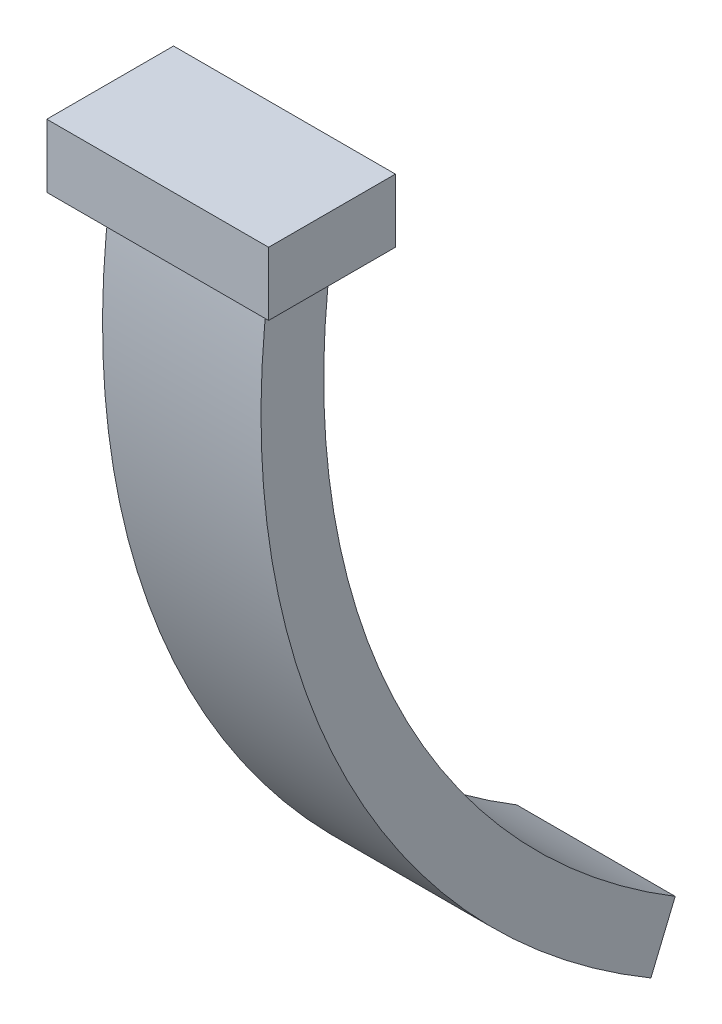
ISO-10303-21;
HEADER;
FILE_DESCRIPTION(('STEP AP214'),'2;1');
FILE_NAME('part.step','',(''),(''),'','','');
FILE_SCHEMA(('AUTOMOTIVE_DESIGN { 1 0 10303 214 1 1 1 1 }'));
ENDSEC;
DATA;
#1=APPLICATION_CONTEXT('core data for automotive mechanical design processes');
#2=APPLICATION_PROTOCOL_DEFINITION('international standard','automotive_design',2000,#1);
#3=PRODUCT_CONTEXT('',#1,'mechanical');
#4=PRODUCT('Part','Part','',(#3));
#5=PRODUCT_RELATED_PRODUCT_CATEGORY('part','',(#4));
#6=PRODUCT_DEFINITION_FORMATION('','',#4);
#7=PRODUCT_DEFINITION_CONTEXT('part definition',#1,'design');
#8=PRODUCT_DEFINITION('design','',#6,#7);
#9=PRODUCT_DEFINITION_SHAPE('','',#8);
#10=(LENGTH_UNIT() NAMED_UNIT(*) SI_UNIT(.MILLI.,.METRE.));
#11=(NAMED_UNIT(*) PLANE_ANGLE_UNIT() SI_UNIT($,.RADIAN.));
#12=(NAMED_UNIT(*) SI_UNIT($,.STERADIAN.) SOLID_ANGLE_UNIT());
#13=UNCERTAINTY_MEASURE_WITH_UNIT(LENGTH_MEASURE(1.E-05),#10,'distance_accuracy_value','');
#14=(GEOMETRIC_REPRESENTATION_CONTEXT(3) GLOBAL_UNCERTAINTY_ASSIGNED_CONTEXT((#13)) GLOBAL_UNIT_ASSIGNED_CONTEXT((#10,
#11,#12)) REPRESENTATION_CONTEXT('',''));
#15=CARTESIAN_POINT('',(0.,0.,0.));
#16=DIRECTION('',(0.,0.,1.));
#17=DIRECTION('',(1.,0.,0.));
#18=AXIS2_PLACEMENT_3D('',#15,#16,#17);
#19=CARTESIAN_POINT('',(0.,-25.,-12.0627518802071));
#20=DIRECTION('',(0.,-0.383592013661249,-0.923502662180954));
#21=DIRECTION('',(0.,0.923502662180954,-0.383592013661249));
#22=AXIS2_PLACEMENT_3D('',#19,#20,#21);
#23=PLANE('',#22);
#24=DIRECTION('',(0.,-0.923502662180954,0.383592013661249));
#25=VECTOR('',#24,1.);
#26=CARTESIAN_POINT('',(0.,-25.,-12.0627518802071));
#27=LINE('',#26,#25);
#28=CARTESIAN_POINT('',(0.,-23.1529946756381,-12.8299359075296));
#29=VERTEX_POINT('',#28);
#30=CARTESIAN_POINT('',(0.,-25.,-12.0627518802071));
#31=VERTEX_POINT('',#30);
#32=EDGE_CURVE('E122',#29,#31,#27,.T.);
#33=ORIENTED_EDGE('',*,*,#32,.F.);
#34=DIRECTION('',(-1.,0.,0.));
#35=VECTOR('',#34,1.);
#36=CARTESIAN_POINT('',(0.,-23.1529946756381,-12.8299359075296));
#37=LINE('',#36,#35);
#38=CARTESIAN_POINT('',(5.,-23.1529946756381,-12.8299359075296));
#39=VERTEX_POINT('',#38);
#40=EDGE_CURVE('E131',#39,#29,#37,.T.);
#41=ORIENTED_EDGE('',*,*,#40,.F.);
#42=DIRECTION('',(0.,0.923502662180954,-0.383592013661249));
#43=VECTOR('',#42,1.);
#44=CARTESIAN_POINT('',(5.,-25.,-12.0627518802071));
#45=LINE('',#44,#43);
#46=CARTESIAN_POINT('',(5.,-25.,-12.0627518802071));
#47=VERTEX_POINT('',#46);
#48=EDGE_CURVE('E214',#47,#39,#45,.T.);
#49=ORIENTED_EDGE('',*,*,#48,.F.);
#50=DIRECTION('',(1.,0.,0.));
#51=VECTOR('',#50,1.);
#52=CARTESIAN_POINT('',(0.,-25.,-12.0627518802071));
#53=LINE('',#52,#51);
#54=EDGE_CURVE('E12',#31,#47,#53,.T.);
#55=ORIENTED_EDGE('',*,*,#54,.F.);
#56=EDGE_LOOP('',(#33,#41,#49,#55));
#57=FACE_BOUND('',#56,.T.);
#58=ADVANCED_FACE('F108',(#57),#23,.T.);
#59=CARTESIAN_POINT('',(5.,0.,0.));
#60=DIRECTION('',(-1.,0.,0.));
#61=DIRECTION('',(0.,0.,1.));
#62=AXIS2_PLACEMENT_3D('',#59,#60,#61);
#63=PLANE('',#62);
#64=CARTESIAN_POINT('',(5.,-3.46379044278194,-24.7588803415763));
#65=DIRECTION('',(1.,0.,0.));
#66=DIRECTION('',(0.,0.150462484500362,0.988615719457251));
#67=AXIS2_PLACEMENT_3D('',#64,#65,#66);
#68=CIRCLE('',#67,23.0209573787385);
#69=CARTESIAN_POINT('',(5.,0.,-2.));
#70=VERTEX_POINT('',#69);
#71=EDGE_CURVE('E216',#70,#39,#68,.T.);
#72=ORIENTED_EDGE('',*,*,#71,.F.);
#73=DIRECTION('',(0.,0.,-1.));
#74=VECTOR('',#73,1.);
#75=CARTESIAN_POINT('',(5.,0.,0.));
#76=LINE('',#75,#74);
#77=CARTESIAN_POINT('',(5.,0.,0.));
#78=VERTEX_POINT('',#77);
#79=EDGE_CURVE('E206',#78,#70,#76,.T.);
#80=ORIENTED_EDGE('',*,*,#79,.F.);
#81=CARTESIAN_POINT('',(5.,-3.46379044278194,-24.7588803415763));
#82=DIRECTION('',(1.,0.,0.));
#83=DIRECTION('',(0.,0.138551617711278,0.990355213663051));
#84=AXIS2_PLACEMENT_3D('',#81,#82,#83);
#85=CIRCLE('',#84,25.);
#86=EDGE_CURVE('E217',#78,#47,#85,.T.);
#87=ORIENTED_EDGE('',*,*,#86,.T.);
#88=ORIENTED_EDGE('',*,*,#48,.T.);
#89=EDGE_LOOP('',(#72,#80,#87,#88));
#90=FACE_BOUND('',#89,.T.);
#91=ADVANCED_FACE('F237',(#90),#63,.F.);
#92=CARTESIAN_POINT('',(0.,-3.46379044278194,-24.7588803415763));
#93=DIRECTION('',(1.,0.,0.));
#94=DIRECTION('',(0.,0.,-1.));
#95=AXIS2_PLACEMENT_3D('',#92,#93,#94);
#96=CYLINDRICAL_SURFACE('',#95,23.0209573787385);
#97=CARTESIAN_POINT('',(0.,-3.46379044278194,-24.7588803415763));
#98=DIRECTION('',(1.,0.,0.));
#99=DIRECTION('',(0.,0.150462484500362,0.988615719457251));
#100=AXIS2_PLACEMENT_3D('',#97,#98,#99);
#101=CIRCLE('',#100,23.0209573787385);
#102=CARTESIAN_POINT('',(0.,0.,-2.));
#103=VERTEX_POINT('',#102);
#104=EDGE_CURVE('E224',#103,#29,#101,.T.);
#105=ORIENTED_EDGE('',*,*,#104,.F.);
#106=DIRECTION('',(-1.,0.,0.));
#107=VECTOR('',#106,1.);
#108=CARTESIAN_POINT('',(0.,0.,-2.));
#109=LINE('',#108,#107);
#110=EDGE_CURVE('E148',#70,#103,#109,.T.);
#111=ORIENTED_EDGE('',*,*,#110,.F.);
#112=ORIENTED_EDGE('',*,*,#71,.T.);
#113=ORIENTED_EDGE('',*,*,#40,.T.);
#114=EDGE_LOOP('',(#105,#111,#112,#113));
#115=FACE_BOUND('',#114,.T.);
#116=ADVANCED_FACE('F238',(#115),#96,.F.);
#117=CARTESIAN_POINT('',(0.,0.,0.));
#118=DIRECTION('',(1.,0.,0.));
#119=DIRECTION('',(0.,0.,-1.));
#120=AXIS2_PLACEMENT_3D('',#117,#118,#119);
#121=PLANE('',#120);
#122=CARTESIAN_POINT('',(0.,-3.46379044278194,-24.7588803415763));
#123=DIRECTION('',(1.,0.,0.));
#124=DIRECTION('',(0.,0.138551617711278,0.990355213663051));
#125=AXIS2_PLACEMENT_3D('',#122,#123,#124);
#126=CIRCLE('',#125,25.);
#127=CARTESIAN_POINT('',(0.,0.,0.));
#128=VERTEX_POINT('',#127);
#129=EDGE_CURVE('E115',#128,#31,#126,.T.);
#130=ORIENTED_EDGE('',*,*,#129,.F.);
#131=DIRECTION('',(0.,0.,1.));
#132=VECTOR('',#131,1.);
#133=CARTESIAN_POINT('',(0.,0.,0.));
#134=LINE('',#133,#132);
#135=EDGE_CURVE('E222',#103,#128,#134,.T.);
#136=ORIENTED_EDGE('',*,*,#135,.F.);
#137=ORIENTED_EDGE('',*,*,#104,.T.);
#138=ORIENTED_EDGE('',*,*,#32,.T.);
#139=EDGE_LOOP('',(#130,#136,#137,#138));
#140=FACE_BOUND('',#139,.T.);
#141=ADVANCED_FACE('F232',(#140),#121,.F.);
#142=CARTESIAN_POINT('',(0.,-3.46379044278194,-24.7588803415763));
#143=DIRECTION('',(1.,0.,0.));
#144=DIRECTION('',(0.,0.,-1.));
#145=AXIS2_PLACEMENT_3D('',#142,#143,#144);
#146=CYLINDRICAL_SURFACE('',#145,25.);
#147=ORIENTED_EDGE('',*,*,#54,.T.);
#148=ORIENTED_EDGE('',*,*,#86,.F.);
#149=DIRECTION('',(1.,0.,0.));
#150=VECTOR('',#149,1.);
#151=CARTESIAN_POINT('',(0.,0.,0.));
#152=LINE('',#151,#150);
#153=EDGE_CURVE('E143',#128,#78,#152,.T.);
#154=ORIENTED_EDGE('',*,*,#153,.F.);
#155=ORIENTED_EDGE('',*,*,#129,.T.);
#156=EDGE_LOOP('',(#147,#148,#154,#155));
#157=FACE_BOUND('',#156,.T.);
#158=ADVANCED_FACE('F233',(#157),#146,.T.);
#159=CARTESIAN_POINT('',(0.,0.,0.));
#160=DIRECTION('',(0.,1.,0.));
#161=DIRECTION('',(0.,0.,1.));
#162=AXIS2_PLACEMENT_3D('',#159,#160,#161);
#163=PLANE('',#162);
#164=DIRECTION('',(0.,0.,-1.));
#165=VECTOR('',#164,1.);
#166=CARTESIAN_POINT('',(6.,0.,0.));
#167=LINE('',#166,#165);
#168=CARTESIAN_POINT('',(6.,0.,1.));
#169=VERTEX_POINT('',#168);
#170=CARTESIAN_POINT('',(6.,0.,-3.));
#171=VERTEX_POINT('',#170);
#172=EDGE_CURVE('E205',#169,#171,#167,.T.);
#173=ORIENTED_EDGE('',*,*,#172,.F.);
#174=DIRECTION('',(1.,0.,0.));
#175=VECTOR('',#174,1.);
#176=CARTESIAN_POINT('',(0.,0.,1.));
#177=LINE('',#176,#175);
#178=CARTESIAN_POINT('',(-1.,0.,1.));
#179=VERTEX_POINT('',#178);
#180=EDGE_CURVE('E201',#179,#169,#177,.T.);
#181=ORIENTED_EDGE('',*,*,#180,.F.);
#182=DIRECTION('',(0.,0.,1.));
#183=VECTOR('',#182,1.);
#184=CARTESIAN_POINT('',(-1.,0.,0.));
#185=LINE('',#184,#183);
#186=CARTESIAN_POINT('',(-1.,0.,-3.));
#187=VERTEX_POINT('',#186);
#188=EDGE_CURVE('E349',#187,#179,#185,.T.);
#189=ORIENTED_EDGE('',*,*,#188,.F.);
#190=DIRECTION('',(-1.,0.,0.));
#191=VECTOR('',#190,1.);
#192=CARTESIAN_POINT('',(0.,0.,-3.));
#193=LINE('',#192,#191);
#194=EDGE_CURVE('E352',#171,#187,#193,.T.);
#195=ORIENTED_EDGE('',*,*,#194,.F.);
#196=EDGE_LOOP('',(#173,#181,#189,#195));
#197=FACE_BOUND('',#196,.T.);
#198=ORIENTED_EDGE('',*,*,#110,.T.);
#199=ORIENTED_EDGE('',*,*,#135,.T.);
#200=ORIENTED_EDGE('',*,*,#153,.T.);
#201=ORIENTED_EDGE('',*,*,#79,.T.);
#202=EDGE_LOOP('',(#198,#199,#200,#201));
#203=FACE_BOUND('',#202,.T.);
#204=ADVANCED_FACE('F230',(#197,#203),#163,.F.);
#205=CARTESIAN_POINT('',(0.,2.,-3.));
#206=DIRECTION('',(0.,0.,1.));
#207=DIRECTION('',(1.,0.,0.));
#208=AXIS2_PLACEMENT_3D('',#205,#206,#207);
#209=PLANE('',#208);
#210=ORIENTED_EDGE('',*,*,#194,.T.);
#211=DIRECTION('',(0.,-1.,0.));
#212=VECTOR('',#211,1.);
#213=CARTESIAN_POINT('',(-1.,2.,-3.));
#214=LINE('',#213,#212);
#215=CARTESIAN_POINT('',(-1.,2.,-3.));
#216=VERTEX_POINT('',#215);
#217=EDGE_CURVE('E188',#216,#187,#214,.T.);
#218=ORIENTED_EDGE('',*,*,#217,.F.);
#219=DIRECTION('',(-1.,0.,0.));
#220=VECTOR('',#219,1.);
#221=CARTESIAN_POINT('',(0.,2.,-3.));
#222=LINE('',#221,#220);
#223=CARTESIAN_POINT('',(6.,2.,-3.));
#224=VERTEX_POINT('',#223);
#225=EDGE_CURVE('E181',#224,#216,#222,.T.);
#226=ORIENTED_EDGE('',*,*,#225,.F.);
#227=DIRECTION('',(0.,-1.,0.));
#228=VECTOR('',#227,1.);
#229=CARTESIAN_POINT('',(6.,2.,-3.));
#230=LINE('',#229,#228);
#231=EDGE_CURVE('E185',#224,#171,#230,.T.);
#232=ORIENTED_EDGE('',*,*,#231,.T.);
#233=EDGE_LOOP('',(#210,#218,#226,#232));
#234=FACE_BOUND('',#233,.T.);
#235=ADVANCED_FACE('F183',(#234),#209,.F.);
#236=CARTESIAN_POINT('',(-1.,2.,0.));
#237=DIRECTION('',(1.,0.,0.));
#238=DIRECTION('',(0.,0.,-1.));
#239=AXIS2_PLACEMENT_3D('',#236,#237,#238);
#240=PLANE('',#239);
#241=ORIENTED_EDGE('',*,*,#188,.T.);
#242=DIRECTION('',(0.,-1.,0.));
#243=VECTOR('',#242,1.);
#244=CARTESIAN_POINT('',(-1.,2.,1.));
#245=LINE('',#244,#243);
#246=CARTESIAN_POINT('',(-1.,2.,1.));
#247=VERTEX_POINT('',#246);
#248=EDGE_CURVE('E210',#247,#179,#245,.T.);
#249=ORIENTED_EDGE('',*,*,#248,.F.);
#250=DIRECTION('',(0.,0.,1.));
#251=VECTOR('',#250,1.);
#252=CARTESIAN_POINT('',(-1.,2.,0.));
#253=LINE('',#252,#251);
#254=EDGE_CURVE('E191',#216,#247,#253,.T.);
#255=ORIENTED_EDGE('',*,*,#254,.F.);
#256=ORIENTED_EDGE('',*,*,#217,.T.);
#257=EDGE_LOOP('',(#241,#249,#255,#256));
#258=FACE_BOUND('',#257,.T.);
#259=ADVANCED_FACE('F256',(#258),#240,.F.);
#260=CARTESIAN_POINT('',(0.,2.,1.));
#261=DIRECTION('',(0.,0.,-1.));
#262=DIRECTION('',(-1.,0.,0.));
#263=AXIS2_PLACEMENT_3D('',#260,#261,#262);
#264=PLANE('',#263);
#265=ORIENTED_EDGE('',*,*,#180,.T.);
#266=DIRECTION('',(0.,-1.,0.));
#267=VECTOR('',#266,1.);
#268=CARTESIAN_POINT('',(6.,2.,1.));
#269=LINE('',#268,#267);
#270=CARTESIAN_POINT('',(6.,2.,1.));
#271=VERTEX_POINT('',#270);
#272=EDGE_CURVE('E346',#271,#169,#269,.T.);
#273=ORIENTED_EDGE('',*,*,#272,.F.);
#274=DIRECTION('',(1.,0.,0.));
#275=VECTOR('',#274,1.);
#276=CARTESIAN_POINT('',(0.,2.,1.));
#277=LINE('',#276,#275);
#278=EDGE_CURVE('E197',#247,#271,#277,.T.);
#279=ORIENTED_EDGE('',*,*,#278,.F.);
#280=ORIENTED_EDGE('',*,*,#248,.T.);
#281=EDGE_LOOP('',(#265,#273,#279,#280));
#282=FACE_BOUND('',#281,.T.);
#283=ADVANCED_FACE('F305',(#282),#264,.F.);
#284=CARTESIAN_POINT('',(6.,2.,0.));
#285=DIRECTION('',(-1.,0.,0.));
#286=DIRECTION('',(0.,0.,1.));
#287=AXIS2_PLACEMENT_3D('',#284,#285,#286);
#288=PLANE('',#287);
#289=ORIENTED_EDGE('',*,*,#172,.T.);
#290=ORIENTED_EDGE('',*,*,#231,.F.);
#291=DIRECTION('',(0.,0.,-1.));
#292=VECTOR('',#291,1.);
#293=CARTESIAN_POINT('',(6.,2.,0.));
#294=LINE('',#293,#292);
#295=EDGE_CURVE('E192',#271,#224,#294,.T.);
#296=ORIENTED_EDGE('',*,*,#295,.F.);
#297=ORIENTED_EDGE('',*,*,#272,.T.);
#298=EDGE_LOOP('',(#289,#290,#296,#297));
#299=FACE_BOUND('',#298,.T.);
#300=ADVANCED_FACE('F203',(#299),#288,.F.);
#301=CARTESIAN_POINT('',(0.,2.,0.));
#302=DIRECTION('',(0.,1.,0.));
#303=DIRECTION('',(0.,0.,1.));
#304=AXIS2_PLACEMENT_3D('',#301,#302,#303);
#305=PLANE('',#304);
#306=ORIENTED_EDGE('',*,*,#295,.T.);
#307=ORIENTED_EDGE('',*,*,#225,.T.);
#308=ORIENTED_EDGE('',*,*,#254,.T.);
#309=ORIENTED_EDGE('',*,*,#278,.T.);
#310=EDGE_LOOP('',(#306,#307,#308,#309));
#311=FACE_BOUND('',#310,.T.);
#312=ADVANCED_FACE('F195',(#311),#305,.T.);
#313=CLOSED_SHELL('',(#58,#91,#116,#141,#158,#204,#235,#259,#283,#300,#312));
#314=MANIFOLD_SOLID_BREP('B2',#313);
#315=ADVANCED_BREP_SHAPE_REPRESENTATION('',(#18,#314),#14);
#316=SHAPE_DEFINITION_REPRESENTATION(#9,#315);
ENDSEC;
END-ISO-10303-21;
